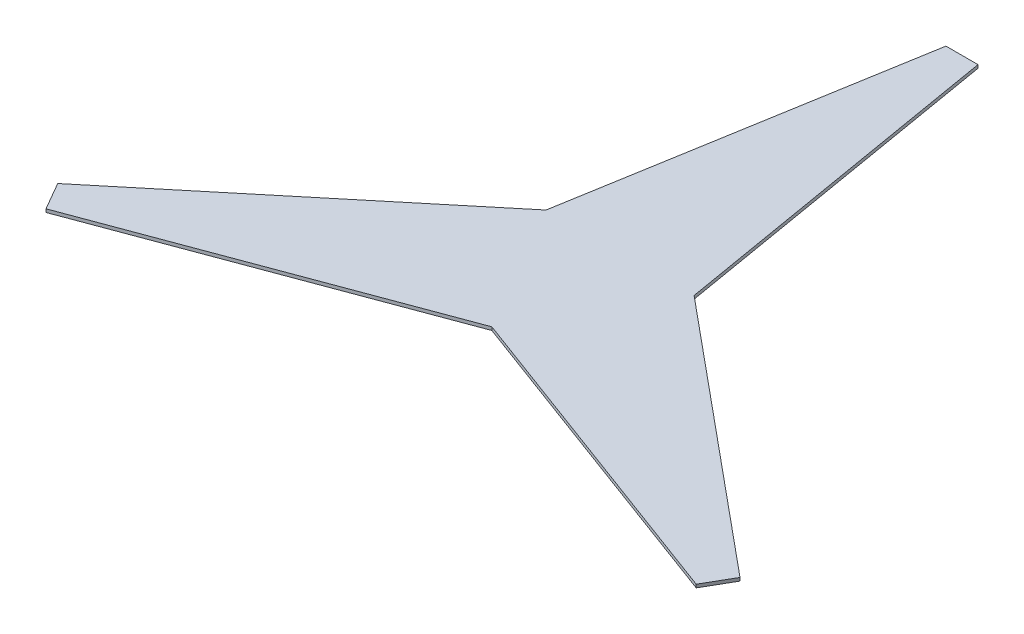
ISO-10303-21;
HEADER;
FILE_DESCRIPTION(('STEP AP214'),'2;1');
FILE_NAME('part.step','',(''),(''),'','','');
FILE_SCHEMA(('AUTOMOTIVE_DESIGN { 1 0 10303 214 1 1 1 1 }'));
ENDSEC;
DATA;
#1=APPLICATION_CONTEXT('core data for automotive mechanical design processes');
#2=APPLICATION_PROTOCOL_DEFINITION('international standard','automotive_design',2000,#1);
#3=PRODUCT_CONTEXT('',#1,'mechanical');
#4=PRODUCT('Part','Part','',(#3));
#5=PRODUCT_RELATED_PRODUCT_CATEGORY('part','',(#4));
#6=PRODUCT_DEFINITION_FORMATION('','',#4);
#7=PRODUCT_DEFINITION_CONTEXT('part definition',#1,'design');
#8=PRODUCT_DEFINITION('design','',#6,#7);
#9=PRODUCT_DEFINITION_SHAPE('','',#8);
#10=(LENGTH_UNIT() NAMED_UNIT(*) SI_UNIT(.MILLI.,.METRE.));
#11=(NAMED_UNIT(*) PLANE_ANGLE_UNIT() SI_UNIT($,.RADIAN.));
#12=(NAMED_UNIT(*) SI_UNIT($,.STERADIAN.) SOLID_ANGLE_UNIT());
#13=UNCERTAINTY_MEASURE_WITH_UNIT(LENGTH_MEASURE(1.E-05),#10,'distance_accuracy_value','');
#14=(GEOMETRIC_REPRESENTATION_CONTEXT(3) GLOBAL_UNCERTAINTY_ASSIGNED_CONTEXT((#13)) GLOBAL_UNIT_ASSIGNED_CONTEXT((#10,
#11,#12)) REPRESENTATION_CONTEXT('',''));
#15=CARTESIAN_POINT('',(0.,0.,0.));
#16=DIRECTION('',(0.,0.,1.));
#17=DIRECTION('',(1.,0.,0.));
#18=AXIS2_PLACEMENT_3D('',#15,#16,#17);
#19=CARTESIAN_POINT('',(-1014.23048454139,10.,643.301270189087));
#20=DIRECTION('',(-0.348111099623069,0.,-0.937453285406381));
#21=DIRECTION('',(-0.937453285406381,0.,0.348111099623069));
#22=AXIS2_PLACEMENT_3D('',#19,#20,#21);
#23=PLANE('',#22);
#24=DIRECTION('',(0.937453285406381,0.,-0.348111099623069));
#25=VECTOR('',#24,1.);
#26=CARTESIAN_POINT('',(-1014.23048454139,0.,643.301270189087));
#27=LINE('',#26,#25);
#28=CARTESIAN_POINT('',(-1014.23048454139,0.,643.301270189087));
#29=VERTEX_POINT('',#28);
#30=CARTESIAN_POINT('',(-7.20069456962796E-11,0.,266.67995503538));
#31=VERTEX_POINT('',#30);
#32=EDGE_CURVE('E152',#29,#31,#27,.T.);
#33=ORIENTED_EDGE('',*,*,#32,.T.);
#34=DIRECTION('',(0.,-1.,0.));
#35=VECTOR('',#34,1.);
#36=CARTESIAN_POINT('',(-7.20069456962796E-11,10.,266.67995503538));
#37=LINE('',#36,#35);
#38=CARTESIAN_POINT('',(-7.20069456962796E-11,10.,266.67995503538));
#39=VERTEX_POINT('',#38);
#40=EDGE_CURVE('E11',#39,#31,#37,.T.);
#41=ORIENTED_EDGE('',*,*,#40,.F.);
#42=DIRECTION('',(0.937453285406381,0.,-0.348111099623069));
#43=VECTOR('',#42,1.);
#44=CARTESIAN_POINT('',(-1014.23048454139,10.,643.301270189087));
#45=LINE('',#44,#43);
#46=CARTESIAN_POINT('',(-1014.23048454139,10.,643.301270189087));
#47=VERTEX_POINT('',#46);
#48=EDGE_CURVE('E177',#47,#39,#45,.T.);
#49=ORIENTED_EDGE('',*,*,#48,.F.);
#50=DIRECTION('',(0.,-1.,0.));
#51=VECTOR('',#50,1.);
#52=CARTESIAN_POINT('',(-1014.23048454139,10.,643.301270189087));
#53=LINE('',#52,#51);
#54=EDGE_CURVE('E148',#47,#29,#53,.T.);
#55=ORIENTED_EDGE('',*,*,#54,.T.);
#56=EDGE_LOOP('',(#33,#41,#49,#55));
#57=FACE_BOUND('',#56,.T.);
#58=ADVANCED_FACE('F45',(#57),#23,.F.);
#59=CARTESIAN_POINT('',(1014.23048454118,10.,643.301270189205));
#60=DIRECTION('',(0.348111099623183,0.,-0.937453285406339));
#61=DIRECTION('',(-0.937453285406339,0.,-0.348111099623183));
#62=AXIS2_PLACEMENT_3D('',#59,#60,#61);
#63=PLANE('',#62);
#64=DIRECTION('',(0.937453285406339,0.,0.348111099623183));
#65=VECTOR('',#64,1.);
#66=CARTESIAN_POINT('',(1014.23048454118,0.,643.301270189205));
#67=LINE('',#66,#65);
#68=CARTESIAN_POINT('',(1014.23048454118,0.,643.301270189205));
#69=VERTEX_POINT('',#68);
#70=EDGE_CURVE('E156',#31,#69,#67,.T.);
#71=ORIENTED_EDGE('',*,*,#70,.T.);
#72=DIRECTION('',(0.,-1.,0.));
#73=VECTOR('',#72,1.);
#74=CARTESIAN_POINT('',(1014.23048454118,10.,643.301270189205));
#75=LINE('',#74,#73);
#76=CARTESIAN_POINT('',(1014.23048454118,10.,643.301270189205));
#77=VERTEX_POINT('',#76);
#78=EDGE_CURVE('E54',#77,#69,#75,.T.);
#79=ORIENTED_EDGE('',*,*,#78,.F.);
#80=DIRECTION('',(0.937453285406339,0.,0.348111099623183));
#81=VECTOR('',#80,1.);
#82=CARTESIAN_POINT('',(1014.23048454118,10.,643.301270189205));
#83=LINE('',#82,#81);
#84=EDGE_CURVE('E108',#39,#77,#83,.T.);
#85=ORIENTED_EDGE('',*,*,#84,.F.);
#86=ORIENTED_EDGE('',*,*,#40,.T.);
#87=EDGE_LOOP('',(#71,#79,#85,#86));
#88=FACE_BOUND('',#87,.T.);
#89=ADVANCED_FACE('F233',(#88),#63,.F.);
#90=CARTESIAN_POINT('',(1064.23048454118,10.,556.698729810761));
#91=DIRECTION('',(-0.866025403784438,0.,-0.5));
#92=DIRECTION('',(-0.5,0.,0.866025403784438));
#93=AXIS2_PLACEMENT_3D('',#90,#91,#92);
#94=PLANE('',#93);
#95=DIRECTION('',(0.5,0.,-0.866025403784438));
#96=VECTOR('',#95,1.);
#97=CARTESIAN_POINT('',(1064.23048454118,0.,556.698729810761));
#98=LINE('',#97,#96);
#99=CARTESIAN_POINT('',(1064.23048454118,0.,556.698729810761));
#100=VERTEX_POINT('',#99);
#101=EDGE_CURVE('E159',#69,#100,#98,.T.);
#102=ORIENTED_EDGE('',*,*,#101,.T.);
#103=DIRECTION('',(0.,-1.,0.));
#104=VECTOR('',#103,1.);
#105=CARTESIAN_POINT('',(1064.23048454118,10.,556.698729810761));
#106=LINE('',#105,#104);
#107=CARTESIAN_POINT('',(1064.23048454118,10.,556.698729810761));
#108=VERTEX_POINT('',#107);
#109=EDGE_CURVE('E192',#108,#100,#106,.T.);
#110=ORIENTED_EDGE('',*,*,#109,.F.);
#111=DIRECTION('',(0.5,0.,-0.866025403784438));
#112=VECTOR('',#111,1.);
#113=CARTESIAN_POINT('',(1064.23048454118,10.,556.698729810761));
#114=LINE('',#113,#112);
#115=EDGE_CURVE('E202',#77,#108,#114,.T.);
#116=ORIENTED_EDGE('',*,*,#115,.F.);
#117=ORIENTED_EDGE('',*,*,#78,.T.);
#118=EDGE_LOOP('',(#102,#110,#116,#117));
#119=FACE_BOUND('',#118,.T.);
#120=ADVANCED_FACE('F200',(#119),#94,.F.);
#121=CARTESIAN_POINT('',(1064.23048454118,10.,556.698729810761));
#122=DIRECTION('',(-0.637802810211575,0.,0.770199698316104));
#123=DIRECTION('',(0.770199698316104,0.,0.637802810211575));
#124=AXIS2_PLACEMENT_3D('',#121,#122,#123);
#125=PLANE('',#124);
#126=DIRECTION('',(-0.770199698316104,0.,-0.637802810211575));
#127=VECTOR('',#126,1.);
#128=CARTESIAN_POINT('',(1064.23048454118,0.,556.698729810761));
#129=LINE('',#128,#127);
#130=CARTESIAN_POINT('',(230.951615740711,0.,-133.339977517762));
#131=VERTEX_POINT('',#130);
#132=EDGE_CURVE('E162',#100,#131,#129,.T.);
#133=ORIENTED_EDGE('',*,*,#132,.T.);
#134=DIRECTION('',(0.,-1.,0.));
#135=VECTOR('',#134,1.);
#136=CARTESIAN_POINT('',(230.951615740711,10.,-133.339977517762));
#137=LINE('',#136,#135);
#138=CARTESIAN_POINT('',(230.951615740711,10.,-133.339977517762));
#139=VERTEX_POINT('',#138);
#140=EDGE_CURVE('E188',#139,#131,#137,.T.);
#141=ORIENTED_EDGE('',*,*,#140,.F.);
#142=DIRECTION('',(-0.770199698316104,0.,-0.637802810211575));
#143=VECTOR('',#142,1.);
#144=CARTESIAN_POINT('',(1064.23048454118,10.,556.698729810761));
#145=LINE('',#144,#143);
#146=EDGE_CURVE('E219',#108,#139,#145,.T.);
#147=ORIENTED_EDGE('',*,*,#146,.F.);
#148=ORIENTED_EDGE('',*,*,#109,.T.);
#149=EDGE_LOOP('',(#133,#141,#147,#148));
#150=FACE_BOUND('',#149,.T.);
#151=ADVANCED_FACE('F211',(#150),#125,.F.);
#152=CARTESIAN_POINT('',(49.9999999999964,10.,-1200.));
#153=DIRECTION('',(-0.985913909834664,0.,0.167253587090162));
#154=DIRECTION('',(0.167253587090162,0.,0.985913909834664));
#155=AXIS2_PLACEMENT_3D('',#152,#153,#154);
#156=PLANE('',#155);
#157=DIRECTION('',(-0.167253587090162,0.,-0.985913909834664));
#158=VECTOR('',#157,1.);
#159=CARTESIAN_POINT('',(49.9999999999964,0.,-1200.));
#160=LINE('',#159,#158);
#161=CARTESIAN_POINT('',(49.9999999999964,0.,-1200.));
#162=VERTEX_POINT('',#161);
#163=EDGE_CURVE('E165',#131,#162,#160,.T.);
#164=ORIENTED_EDGE('',*,*,#163,.T.);
#165=DIRECTION('',(0.,-1.,0.));
#166=VECTOR('',#165,1.);
#167=CARTESIAN_POINT('',(49.9999999999964,10.,-1200.));
#168=LINE('',#167,#166);
#169=CARTESIAN_POINT('',(49.9999999999964,10.,-1200.));
#170=VERTEX_POINT('',#169);
#171=EDGE_CURVE('E184',#170,#162,#168,.T.);
#172=ORIENTED_EDGE('',*,*,#171,.F.);
#173=DIRECTION('',(-0.167253587090162,0.,-0.985913909834664));
#174=VECTOR('',#173,1.);
#175=CARTESIAN_POINT('',(49.9999999999964,10.,-1200.));
#176=LINE('',#175,#174);
#177=EDGE_CURVE('E217',#139,#170,#176,.T.);
#178=ORIENTED_EDGE('',*,*,#177,.F.);
#179=ORIENTED_EDGE('',*,*,#140,.T.);
#180=EDGE_LOOP('',(#164,#172,#178,#179));
#181=FACE_BOUND('',#180,.T.);
#182=ADVANCED_FACE('F215',(#181),#156,.F.);
#183=CARTESIAN_POINT('',(-50.,10.,-1200.));
#184=DIRECTION('',(0.,0.,1.));
#185=DIRECTION('',(1.,0.,0.));
#186=AXIS2_PLACEMENT_3D('',#183,#184,#185);
#187=PLANE('',#186);
#188=DIRECTION('',(-1.,0.,0.));
#189=VECTOR('',#188,1.);
#190=CARTESIAN_POINT('',(-50.,0.,-1200.));
#191=LINE('',#190,#189);
#192=CARTESIAN_POINT('',(-50.,0.,-1200.));
#193=VERTEX_POINT('',#192);
#194=EDGE_CURVE('E168',#162,#193,#191,.T.);
#195=ORIENTED_EDGE('',*,*,#194,.T.);
#196=DIRECTION('',(0.,-1.,0.));
#197=VECTOR('',#196,1.);
#198=CARTESIAN_POINT('',(-50.,10.,-1200.));
#199=LINE('',#198,#197);
#200=CARTESIAN_POINT('',(-50.,10.,-1200.));
#201=VERTEX_POINT('',#200);
#202=EDGE_CURVE('E141',#201,#193,#199,.T.);
#203=ORIENTED_EDGE('',*,*,#202,.F.);
#204=DIRECTION('',(-1.,0.,0.));
#205=VECTOR('',#204,1.);
#206=CARTESIAN_POINT('',(-50.,10.,-1200.));
#207=LINE('',#206,#205);
#208=EDGE_CURVE('E130',#170,#201,#207,.T.);
#209=ORIENTED_EDGE('',*,*,#208,.F.);
#210=ORIENTED_EDGE('',*,*,#171,.T.);
#211=EDGE_LOOP('',(#195,#203,#209,#210));
#212=FACE_BOUND('',#211,.T.);
#213=ADVANCED_FACE('F245',(#212),#187,.F.);
#214=CARTESIAN_POINT('',(-50.,10.,-1200.));
#215=DIRECTION('',(0.985913909834644,0.,0.167253587090278));
#216=DIRECTION('',(0.167253587090278,0.,-0.985913909834644));
#217=AXIS2_PLACEMENT_3D('',#214,#215,#216);
#218=PLANE('',#217);
#219=DIRECTION('',(-0.167253587090278,0.,0.985913909834644));
#220=VECTOR('',#219,1.);
#221=CARTESIAN_POINT('',(-50.,0.,-1200.));
#222=LINE('',#221,#220);
#223=CARTESIAN_POINT('',(-230.951615740841,0.,-133.33997751777));
#224=VERTEX_POINT('',#223);
#225=EDGE_CURVE('E139',#193,#224,#222,.T.);
#226=ORIENTED_EDGE('',*,*,#225,.T.);
#227=DIRECTION('',(0.,-1.,0.));
#228=VECTOR('',#227,1.);
#229=CARTESIAN_POINT('',(-230.951615740841,10.,-133.33997751777));
#230=LINE('',#229,#228);
#231=CARTESIAN_POINT('',(-230.951615740841,10.,-133.33997751777));
#232=VERTEX_POINT('',#231);
#233=EDGE_CURVE('E136',#232,#224,#230,.T.);
#234=ORIENTED_EDGE('',*,*,#233,.F.);
#235=DIRECTION('',(-0.167253587090278,0.,0.985913909834644));
#236=VECTOR('',#235,1.);
#237=CARTESIAN_POINT('',(-50.,10.,-1200.));
#238=LINE('',#237,#236);
#239=EDGE_CURVE('E124',#201,#232,#238,.T.);
#240=ORIENTED_EDGE('',*,*,#239,.F.);
#241=ORIENTED_EDGE('',*,*,#202,.T.);
#242=EDGE_LOOP('',(#226,#234,#240,#241));
#243=FACE_BOUND('',#242,.T.);
#244=ADVANCED_FACE('F137',(#243),#218,.F.);
#245=CARTESIAN_POINT('',(-1064.23048454139,10.,556.698729810645));
#246=DIRECTION('',(0.637802810211482,0.,0.770199698316181));
#247=DIRECTION('',(0.770199698316181,0.,-0.637802810211482));
#248=AXIS2_PLACEMENT_3D('',#245,#246,#247);
#249=PLANE('',#248);
#250=DIRECTION('',(-0.770199698316181,0.,0.637802810211482));
#251=VECTOR('',#250,1.);
#252=CARTESIAN_POINT('',(-1064.23048454139,0.,556.698729810645));
#253=LINE('',#252,#251);
#254=CARTESIAN_POINT('',(-1064.23048454139,0.,556.698729810645));
#255=VERTEX_POINT('',#254);
#256=EDGE_CURVE('E94',#224,#255,#253,.T.);
#257=ORIENTED_EDGE('',*,*,#256,.T.);
#258=DIRECTION('',(0.,-1.,0.));
#259=VECTOR('',#258,1.);
#260=CARTESIAN_POINT('',(-1064.23048454139,10.,556.698729810645));
#261=LINE('',#260,#259);
#262=CARTESIAN_POINT('',(-1064.23048454139,10.,556.698729810645));
#263=VERTEX_POINT('',#262);
#264=EDGE_CURVE('E142',#263,#255,#261,.T.);
#265=ORIENTED_EDGE('',*,*,#264,.F.);
#266=DIRECTION('',(-0.770199698316181,0.,0.637802810211482));
#267=VECTOR('',#266,1.);
#268=CARTESIAN_POINT('',(-1064.23048454139,10.,556.698729810645));
#269=LINE('',#268,#267);
#270=EDGE_CURVE('E128',#232,#263,#269,.T.);
#271=ORIENTED_EDGE('',*,*,#270,.F.);
#272=ORIENTED_EDGE('',*,*,#233,.T.);
#273=EDGE_LOOP('',(#257,#265,#271,#272));
#274=FACE_BOUND('',#273,.T.);
#275=ADVANCED_FACE('F144',(#274),#249,.F.);
#276=CARTESIAN_POINT('',(-1064.23048454139,10.,556.698729810645));
#277=DIRECTION('',(0.866025403784438,0.,-0.500000000000002));
#278=DIRECTION('',(-0.500000000000002,0.,-0.866025403784438));
#279=AXIS2_PLACEMENT_3D('',#276,#277,#278);
#280=PLANE('',#279);
#281=DIRECTION('',(0.500000000000002,0.,0.866025403784438));
#282=VECTOR('',#281,1.);
#283=CARTESIAN_POINT('',(-1064.23048454139,0.,556.698729810645));
#284=LINE('',#283,#282);
#285=EDGE_CURVE('E100',#255,#29,#284,.T.);
#286=ORIENTED_EDGE('',*,*,#285,.T.);
#287=ORIENTED_EDGE('',*,*,#54,.F.);
#288=DIRECTION('',(0.500000000000002,0.,0.866025403784438));
#289=VECTOR('',#288,1.);
#290=CARTESIAN_POINT('',(-1064.23048454139,10.,556.698729810645));
#291=LINE('',#290,#289);
#292=EDGE_CURVE('E62',#263,#47,#291,.T.);
#293=ORIENTED_EDGE('',*,*,#292,.F.);
#294=ORIENTED_EDGE('',*,*,#264,.T.);
#295=EDGE_LOOP('',(#286,#287,#293,#294));
#296=FACE_BOUND('',#295,.T.);
#297=ADVANCED_FACE('F253',(#296),#280,.F.);
#298=CARTESIAN_POINT('',(0.,10.,0.));
#299=DIRECTION('',(0.,-1.,0.));
#300=DIRECTION('',(0.,0.,-1.));
#301=AXIS2_PLACEMENT_3D('',#298,#299,#300);
#302=PLANE('',#301);
#303=ORIENTED_EDGE('',*,*,#48,.T.);
#304=ORIENTED_EDGE('',*,*,#84,.T.);
#305=ORIENTED_EDGE('',*,*,#115,.T.);
#306=ORIENTED_EDGE('',*,*,#146,.T.);
#307=ORIENTED_EDGE('',*,*,#177,.T.);
#308=ORIENTED_EDGE('',*,*,#208,.T.);
#309=ORIENTED_EDGE('',*,*,#239,.T.);
#310=ORIENTED_EDGE('',*,*,#270,.T.);
#311=ORIENTED_EDGE('',*,*,#292,.T.);
#312=EDGE_LOOP('',(#303,#304,#305,#306,#307,#308,#309,#310,#311));
#313=FACE_BOUND('',#312,.T.);
#314=ADVANCED_FACE('F126',(#313),#302,.F.);
#315=CARTESIAN_POINT('',(0.,0.,0.));
#316=DIRECTION('',(0.,-1.,0.));
#317=DIRECTION('',(0.,0.,-1.));
#318=AXIS2_PLACEMENT_3D('',#315,#316,#317);
#319=PLANE('',#318);
#320=ORIENTED_EDGE('',*,*,#32,.F.);
#321=ORIENTED_EDGE('',*,*,#285,.F.);
#322=ORIENTED_EDGE('',*,*,#256,.F.);
#323=ORIENTED_EDGE('',*,*,#225,.F.);
#324=ORIENTED_EDGE('',*,*,#194,.F.);
#325=ORIENTED_EDGE('',*,*,#163,.F.);
#326=ORIENTED_EDGE('',*,*,#132,.F.);
#327=ORIENTED_EDGE('',*,*,#101,.F.);
#328=ORIENTED_EDGE('',*,*,#70,.F.);
#329=EDGE_LOOP('',(#320,#321,#322,#323,#324,#325,#326,#327,#328));
#330=FACE_BOUND('',#329,.T.);
#331=ADVANCED_FACE('F206',(#330),#319,.T.);
#332=CLOSED_SHELL('',(#58,#89,#120,#151,#182,#213,#244,#275,#297,#314,#331));
#333=MANIFOLD_SOLID_BREP('B2',#332);
#334=ADVANCED_BREP_SHAPE_REPRESENTATION('',(#18,#333),#14);
#335=SHAPE_DEFINITION_REPRESENTATION(#9,#334);
ENDSEC;
END-ISO-10303-21;
